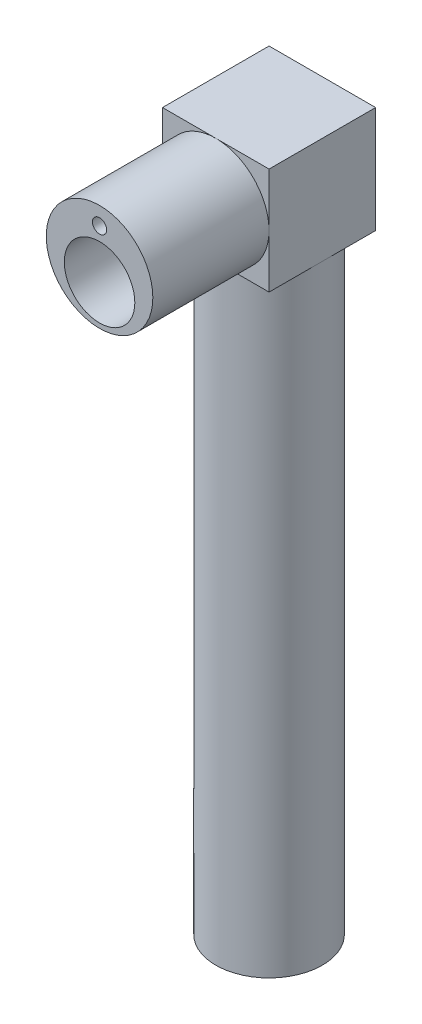
ISO-10303-21;
HEADER;
FILE_DESCRIPTION(('STEP AP214'),'2;1');
FILE_NAME('part.step','',(''),(''),'','','');
FILE_SCHEMA(('AUTOMOTIVE_DESIGN { 1 0 10303 214 1 1 1 1 }'));
ENDSEC;
DATA;
#1=APPLICATION_CONTEXT('core data for automotive mechanical design processes');
#2=APPLICATION_PROTOCOL_DEFINITION('international standard','automotive_design',2000,#1);
#3=PRODUCT_CONTEXT('',#1,'mechanical');
#4=PRODUCT('Part','Part','',(#3));
#5=PRODUCT_RELATED_PRODUCT_CATEGORY('part','',(#4));
#6=PRODUCT_DEFINITION_FORMATION('','',#4);
#7=PRODUCT_DEFINITION_CONTEXT('part definition',#1,'design');
#8=PRODUCT_DEFINITION('design','',#6,#7);
#9=PRODUCT_DEFINITION_SHAPE('','',#8);
#10=(LENGTH_UNIT() NAMED_UNIT(*) SI_UNIT(.MILLI.,.METRE.));
#11=(NAMED_UNIT(*) PLANE_ANGLE_UNIT() SI_UNIT($,.RADIAN.));
#12=(NAMED_UNIT(*) SI_UNIT($,.STERADIAN.) SOLID_ANGLE_UNIT());
#13=UNCERTAINTY_MEASURE_WITH_UNIT(LENGTH_MEASURE(1.E-05),#10,'distance_accuracy_value','');
#14=(GEOMETRIC_REPRESENTATION_CONTEXT(3) GLOBAL_UNCERTAINTY_ASSIGNED_CONTEXT((#13)) GLOBAL_UNIT_ASSIGNED_CONTEXT((#10,
#11,#12)) REPRESENTATION_CONTEXT('',''));
#15=CARTESIAN_POINT('',(0.,0.,0.));
#16=DIRECTION('',(0.,0.,1.));
#17=DIRECTION('',(1.,0.,0.));
#18=AXIS2_PLACEMENT_3D('',#15,#16,#17);
#19=CARTESIAN_POINT('',(28.1,-28.1,-56.2));
#20=DIRECTION('',(0.,1.,0.));
#21=DIRECTION('',(0.,0.,1.));
#22=AXIS2_PLACEMENT_3D('',#19,#20,#21);
#23=PLANE('',#22);
#24=CARTESIAN_POINT('',(0.,-28.1,-28.1));
#25=DIRECTION('',(0.,-1.,0.));
#26=DIRECTION('',(0.,0.,-1.));
#27=AXIS2_PLACEMENT_3D('',#24,#25,#26);
#28=CIRCLE('',#27,28.1);
#29=CARTESIAN_POINT('',(0.,-28.1,0.));
#30=VERTEX_POINT('',#29);
#31=CARTESIAN_POINT('',(-28.1,-28.1,-28.1));
#32=VERTEX_POINT('',#31);
#33=EDGE_CURVE('E408',#30,#32,#28,.T.);
#34=ORIENTED_EDGE('',*,*,#33,.F.);
#35=DIRECTION('',(-1.,0.,0.));
#36=VECTOR('',#35,1.);
#37=CARTESIAN_POINT('',(28.1,-28.1,0.));
#38=LINE('',#37,#36);
#39=CARTESIAN_POINT('',(-28.1,-28.1,0.));
#40=VERTEX_POINT('',#39);
#41=EDGE_CURVE('E311',#30,#40,#38,.T.);
#42=ORIENTED_EDGE('',*,*,#41,.T.);
#43=DIRECTION('',(0.,0.,1.));
#44=VECTOR('',#43,1.);
#45=CARTESIAN_POINT('',(-28.1,-28.1,-56.2));
#46=LINE('',#45,#44);
#47=EDGE_CURVE('E300',#32,#40,#46,.T.);
#48=ORIENTED_EDGE('',*,*,#47,.F.);
#49=EDGE_LOOP('',(#34,#42,#48));
#50=FACE_BOUND('',#49,.T.);
#51=ADVANCED_FACE('F36',(#50),#23,.F.);
#52=CARTESIAN_POINT('',(0.,-28.1,-56.2));
#53=VERTEX_POINT('',#52);
#54=EDGE_CURVE('E233',#32,#53,#28,.T.);
#55=ORIENTED_EDGE('',*,*,#54,.F.);
#56=CARTESIAN_POINT('',(-28.1,-28.1,-56.2));
#57=VERTEX_POINT('',#56);
#58=EDGE_CURVE('E314',#57,#32,#46,.T.);
#59=ORIENTED_EDGE('',*,*,#58,.F.);
#60=DIRECTION('',(-1.,0.,0.));
#61=VECTOR('',#60,1.);
#62=CARTESIAN_POINT('',(28.1,-28.1,-56.2));
#63=LINE('',#62,#61);
#64=EDGE_CURVE('E296',#53,#57,#63,.T.);
#65=ORIENTED_EDGE('',*,*,#64,.F.);
#66=EDGE_LOOP('',(#55,#59,#65));
#67=FACE_BOUND('',#66,.T.);
#68=ADVANCED_FACE('F363',(#67),#23,.F.);
#69=CARTESIAN_POINT('',(28.1,-28.1,-28.1));
#70=VERTEX_POINT('',#69);
#71=EDGE_CURVE('E246',#53,#70,#28,.T.);
#72=ORIENTED_EDGE('',*,*,#71,.F.);
#73=CARTESIAN_POINT('',(28.1,-28.1,-56.2));
#74=VERTEX_POINT('',#73);
#75=EDGE_CURVE('E297',#74,#53,#63,.T.);
#76=ORIENTED_EDGE('',*,*,#75,.F.);
#77=DIRECTION('',(0.,0.,1.));
#78=VECTOR('',#77,1.);
#79=CARTESIAN_POINT('',(28.1,-28.1,-56.2));
#80=LINE('',#79,#78);
#81=EDGE_CURVE('E318',#74,#70,#80,.T.);
#82=ORIENTED_EDGE('',*,*,#81,.T.);
#83=EDGE_LOOP('',(#72,#76,#82));
#84=FACE_BOUND('',#83,.T.);
#85=ADVANCED_FACE('F370',(#84),#23,.F.);
#86=CARTESIAN_POINT('',(0.,0.,61.3));
#87=DIRECTION('',(0.,0.,-1.));
#88=DIRECTION('',(-1.,0.,0.));
#89=AXIS2_PLACEMENT_3D('',#86,#87,#88);
#90=CYLINDRICAL_SURFACE('',#89,28.1);
#91=CARTESIAN_POINT('',(0.,0.,61.3));
#92=DIRECTION('',(0.,0.,1.));
#93=DIRECTION('',(1.,0.,0.));
#94=AXIS2_PLACEMENT_3D('',#91,#92,#93);
#95=CIRCLE('',#94,28.1);
#96=CARTESIAN_POINT('',(28.1,0.,61.3));
#97=VERTEX_POINT('',#96);
#98=EDGE_CURVE('E45',#97,#97,#95,.T.);
#99=ORIENTED_EDGE('',*,*,#98,.F.);
#100=EDGE_LOOP('',(#99));
#101=FACE_BOUND('',#100,.T.);
#102=CARTESIAN_POINT('',(0.,0.,0.));
#103=DIRECTION('',(0.,0.,1.));
#104=DIRECTION('',(1.,0.,0.));
#105=AXIS2_PLACEMENT_3D('',#102,#103,#104);
#106=CIRCLE('',#105,28.1);
#107=CARTESIAN_POINT('',(28.1,0.,0.));
#108=VERTEX_POINT('',#107);
#109=CARTESIAN_POINT('',(0.,28.1,0.));
#110=VERTEX_POINT('',#109);
#111=EDGE_CURVE('E336',#108,#110,#106,.T.);
#112=ORIENTED_EDGE('',*,*,#111,.T.);
#113=CARTESIAN_POINT('',(-28.1,0.,0.));
#114=VERTEX_POINT('',#113);
#115=EDGE_CURVE('E338',#110,#114,#106,.T.);
#116=ORIENTED_EDGE('',*,*,#115,.T.);
#117=EDGE_CURVE('E421',#114,#30,#106,.T.);
#118=ORIENTED_EDGE('',*,*,#117,.T.);
#119=EDGE_CURVE('E331',#30,#108,#106,.T.);
#120=ORIENTED_EDGE('',*,*,#119,.T.);
#121=EDGE_LOOP('',(#112,#116,#118,#120));
#122=FACE_BOUND('',#121,.T.);
#123=ADVANCED_FACE('F38',(#101,#122),#90,.T.);
#124=CARTESIAN_POINT('',(0.,0.,61.3));
#125=DIRECTION('',(0.,0.,1.));
#126=DIRECTION('',(1.,0.,0.));
#127=AXIS2_PLACEMENT_3D('',#124,#125,#126);
#128=PLANE('',#127);
#129=CARTESIAN_POINT('',(0.,18.75,61.3));
#130=DIRECTION('',(0.,0.,1.));
#131=DIRECTION('',(1.,0.,0.));
#132=AXIS2_PLACEMENT_3D('',#129,#130,#131);
#133=CIRCLE('',#132,3.75);
#134=CARTESIAN_POINT('',(3.75,18.75,61.3));
#135=VERTEX_POINT('',#134);
#136=EDGE_CURVE('E618',#135,#135,#133,.T.);
#137=ORIENTED_EDGE('',*,*,#136,.F.);
#138=EDGE_LOOP('',(#137));
#139=FACE_BOUND('',#138,.T.);
#140=CARTESIAN_POINT('',(0.,-7.,61.3));
#141=DIRECTION('',(0.,0.,1.));
#142=DIRECTION('',(1.,0.,0.));
#143=AXIS2_PLACEMENT_3D('',#140,#141,#142);
#144=CIRCLE('',#143,18.6);
#145=CARTESIAN_POINT('',(18.6,-7.,61.3));
#146=VERTEX_POINT('',#145);
#147=EDGE_CURVE('E327',#146,#146,#144,.T.);
#148=ORIENTED_EDGE('',*,*,#147,.F.);
#149=EDGE_LOOP('',(#148));
#150=FACE_BOUND('',#149,.T.);
#151=ORIENTED_EDGE('',*,*,#98,.T.);
#152=EDGE_LOOP('',(#151));
#153=FACE_BOUND('',#152,.T.);
#154=ADVANCED_FACE('F393',(#139,#150,#153),#128,.T.);
#155=CARTESIAN_POINT('',(0.,-7.,2.5));
#156=DIRECTION('',(0.,0.,1.));
#157=DIRECTION('',(1.,0.,0.));
#158=AXIS2_PLACEMENT_3D('',#155,#156,#157);
#159=CYLINDRICAL_SURFACE('',#158,18.6);
#160=CARTESIAN_POINT('',(0.,-7.,2.5));
#161=DIRECTION('',(0.,0.,1.));
#162=DIRECTION('',(1.,0.,0.));
#163=AXIS2_PLACEMENT_3D('',#160,#161,#162);
#164=CIRCLE('',#163,18.6);
#165=CARTESIAN_POINT('',(18.6,-7.,2.5));
#166=VERTEX_POINT('',#165);
#167=EDGE_CURVE('E328',#166,#166,#164,.T.);
#168=ORIENTED_EDGE('',*,*,#167,.F.);
#169=EDGE_LOOP('',(#168));
#170=FACE_BOUND('',#169,.T.);
#171=ORIENTED_EDGE('',*,*,#147,.T.);
#172=EDGE_LOOP('',(#171));
#173=FACE_BOUND('',#172,.T.);
#174=ADVANCED_FACE('F546',(#170,#173),#159,.F.);
#175=CARTESIAN_POINT('',(0.,-7.,2.5));
#176=DIRECTION('',(0.,0.,1.));
#177=DIRECTION('',(1.,0.,0.));
#178=AXIS2_PLACEMENT_3D('',#175,#176,#177);
#179=PLANE('',#178);
#180=CARTESIAN_POINT('',(0.,-7.,2.5));
#181=DIRECTION('',(0.,0.,1.));
#182=DIRECTION('',(1.,0.,0.));
#183=AXIS2_PLACEMENT_3D('',#180,#181,#182);
#184=CIRCLE('',#183,16.1);
#185=CARTESIAN_POINT('',(16.1,-7.,2.5));
#186=VERTEX_POINT('',#185);
#187=EDGE_CURVE('E284',#186,#186,#184,.T.);
#188=ORIENTED_EDGE('',*,*,#187,.F.);
#189=EDGE_LOOP('',(#188));
#190=FACE_BOUND('',#189,.T.);
#191=ORIENTED_EDGE('',*,*,#167,.T.);
#192=EDGE_LOOP('',(#191));
#193=FACE_BOUND('',#192,.T.);
#194=ADVANCED_FACE('F445',(#190,#193),#179,.T.);
#195=CARTESIAN_POINT('',(0.,0.,0.));
#196=DIRECTION('',(0.,0.,1.));
#197=DIRECTION('',(1.,0.,0.));
#198=AXIS2_PLACEMENT_3D('',#195,#196,#197);
#199=PLANE('',#198);
#200=ORIENTED_EDGE('',*,*,#111,.F.);
#201=DIRECTION('',(0.,-1.,0.));
#202=VECTOR('',#201,1.);
#203=CARTESIAN_POINT('',(28.1,-28.1,0.));
#204=LINE('',#203,#202);
#205=CARTESIAN_POINT('',(28.1,28.1,0.));
#206=VERTEX_POINT('',#205);
#207=EDGE_CURVE('E309',#206,#108,#204,.T.);
#208=ORIENTED_EDGE('',*,*,#207,.F.);
#209=DIRECTION('',(1.,0.,0.));
#210=VECTOR('',#209,1.);
#211=CARTESIAN_POINT('',(28.1,28.1,0.));
#212=LINE('',#211,#210);
#213=EDGE_CURVE('E304',#110,#206,#212,.T.);
#214=ORIENTED_EDGE('',*,*,#213,.F.);
#215=EDGE_LOOP('',(#200,#208,#214));
#216=FACE_BOUND('',#215,.T.);
#217=ADVANCED_FACE('F431',(#216),#199,.T.);
#218=ORIENTED_EDGE('',*,*,#115,.F.);
#219=CARTESIAN_POINT('',(-28.1,28.1,0.));
#220=VERTEX_POINT('',#219);
#221=EDGE_CURVE('E305',#220,#110,#212,.T.);
#222=ORIENTED_EDGE('',*,*,#221,.F.);
#223=DIRECTION('',(0.,1.,0.));
#224=VECTOR('',#223,1.);
#225=CARTESIAN_POINT('',(-28.1,-28.1,0.));
#226=LINE('',#225,#224);
#227=EDGE_CURVE('E287',#114,#220,#226,.T.);
#228=ORIENTED_EDGE('',*,*,#227,.F.);
#229=EDGE_LOOP('',(#218,#222,#228));
#230=FACE_BOUND('',#229,.T.);
#231=ADVANCED_FACE('F436',(#230),#199,.T.);
#232=ORIENTED_EDGE('',*,*,#117,.F.);
#233=EDGE_CURVE('E301',#40,#114,#226,.T.);
#234=ORIENTED_EDGE('',*,*,#233,.F.);
#235=ORIENTED_EDGE('',*,*,#41,.F.);
#236=EDGE_LOOP('',(#232,#234,#235));
#237=FACE_BOUND('',#236,.T.);
#238=ADVANCED_FACE('F438',(#237),#199,.T.);
#239=ORIENTED_EDGE('',*,*,#119,.F.);
#240=CARTESIAN_POINT('',(28.1,-28.1,0.));
#241=VERTEX_POINT('',#240);
#242=EDGE_CURVE('E292',#241,#30,#38,.T.);
#243=ORIENTED_EDGE('',*,*,#242,.F.);
#244=EDGE_CURVE('E308',#108,#241,#204,.T.);
#245=ORIENTED_EDGE('',*,*,#244,.F.);
#246=EDGE_LOOP('',(#239,#243,#245));
#247=FACE_BOUND('',#246,.T.);
#248=ADVANCED_FACE('F418',(#247),#199,.T.);
#249=CARTESIAN_POINT('',(-28.1,-28.1,-56.2));
#250=DIRECTION('',(1.,0.,0.));
#251=DIRECTION('',(0.,0.,-1.));
#252=AXIS2_PLACEMENT_3D('',#249,#250,#251);
#253=PLANE('',#252);
#254=ORIENTED_EDGE('',*,*,#233,.T.);
#255=ORIENTED_EDGE('',*,*,#227,.T.);
#256=DIRECTION('',(0.,0.,1.));
#257=VECTOR('',#256,1.);
#258=CARTESIAN_POINT('',(-28.1,28.1,-56.2));
#259=LINE('',#258,#257);
#260=CARTESIAN_POINT('',(-28.1,28.1,-56.2));
#261=VERTEX_POINT('',#260);
#262=EDGE_CURVE('E324',#261,#220,#259,.T.);
#263=ORIENTED_EDGE('',*,*,#262,.F.);
#264=DIRECTION('',(0.,1.,0.));
#265=VECTOR('',#264,1.);
#266=CARTESIAN_POINT('',(-28.1,-28.1,-56.2));
#267=LINE('',#266,#265);
#268=EDGE_CURVE('E288',#57,#261,#267,.T.);
#269=ORIENTED_EDGE('',*,*,#268,.F.);
#270=ORIENTED_EDGE('',*,*,#58,.T.);
#271=ORIENTED_EDGE('',*,*,#47,.T.);
#272=EDGE_LOOP('',(#254,#255,#263,#269,#270,#271));
#273=FACE_BOUND('',#272,.T.);
#274=ADVANCED_FACE('F425',(#273),#253,.F.);
#275=CARTESIAN_POINT('',(28.1,28.1,-56.2));
#276=DIRECTION('',(0.,-1.,0.));
#277=DIRECTION('',(0.,0.,-1.));
#278=AXIS2_PLACEMENT_3D('',#275,#276,#277);
#279=PLANE('',#278);
#280=ORIENTED_EDGE('',*,*,#221,.T.);
#281=ORIENTED_EDGE('',*,*,#213,.T.);
#282=DIRECTION('',(0.,0.,1.));
#283=VECTOR('',#282,1.);
#284=CARTESIAN_POINT('',(28.1,28.1,-56.2));
#285=LINE('',#284,#283);
#286=CARTESIAN_POINT('',(28.1,28.1,-56.2));
#287=VERTEX_POINT('',#286);
#288=EDGE_CURVE('E321',#287,#206,#285,.T.);
#289=ORIENTED_EDGE('',*,*,#288,.F.);
#290=DIRECTION('',(1.,0.,0.));
#291=VECTOR('',#290,1.);
#292=CARTESIAN_POINT('',(28.1,28.1,-56.2));
#293=LINE('',#292,#291);
#294=EDGE_CURVE('E291',#261,#287,#293,.T.);
#295=ORIENTED_EDGE('',*,*,#294,.F.);
#296=ORIENTED_EDGE('',*,*,#262,.T.);
#297=EDGE_LOOP('',(#280,#281,#289,#295,#296));
#298=FACE_BOUND('',#297,.T.);
#299=ADVANCED_FACE('F386',(#298),#279,.F.);
#300=CARTESIAN_POINT('',(28.1,-28.1,-56.2));
#301=DIRECTION('',(-1.,0.,0.));
#302=DIRECTION('',(0.,0.,1.));
#303=AXIS2_PLACEMENT_3D('',#300,#301,#302);
#304=PLANE('',#303);
#305=ORIENTED_EDGE('',*,*,#207,.T.);
#306=ORIENTED_EDGE('',*,*,#244,.T.);
#307=EDGE_CURVE('E317',#70,#241,#80,.T.);
#308=ORIENTED_EDGE('',*,*,#307,.F.);
#309=ORIENTED_EDGE('',*,*,#81,.F.);
#310=DIRECTION('',(0.,-1.,0.));
#311=VECTOR('',#310,1.);
#312=CARTESIAN_POINT('',(28.1,-28.1,-56.2));
#313=LINE('',#312,#311);
#314=EDGE_CURVE('E294',#287,#74,#313,.T.);
#315=ORIENTED_EDGE('',*,*,#314,.F.);
#316=ORIENTED_EDGE('',*,*,#288,.T.);
#317=EDGE_LOOP('',(#305,#306,#308,#309,#315,#316));
#318=FACE_BOUND('',#317,.T.);
#319=ADVANCED_FACE('F377',(#318),#304,.F.);
#320=EDGE_CURVE('E249',#70,#30,#28,.T.);
#321=ORIENTED_EDGE('',*,*,#320,.F.);
#322=ORIENTED_EDGE('',*,*,#307,.T.);
#323=ORIENTED_EDGE('',*,*,#242,.T.);
#324=EDGE_LOOP('',(#321,#322,#323));
#325=FACE_BOUND('',#324,.T.);
#326=ADVANCED_FACE('F366',(#325),#23,.F.);
#327=CARTESIAN_POINT('',(0.,0.,-56.2));
#328=DIRECTION('',(0.,0.,1.));
#329=DIRECTION('',(1.,0.,0.));
#330=AXIS2_PLACEMENT_3D('',#327,#328,#329);
#331=PLANE('',#330);
#332=DIRECTION('',(1.,0.,0.));
#333=VECTOR('',#332,1.);
#334=CARTESIAN_POINT('',(24.8986957114994,24.8896277262816,-56.2));
#335=LINE('',#334,#333);
#336=CARTESIAN_POINT('',(-24.8986957114994,24.8896277262816,-56.2));
#337=VERTEX_POINT('',#336);
#338=CARTESIAN_POINT('',(24.8986957114994,24.8896277262816,-56.2));
#339=VERTEX_POINT('',#338);
#340=EDGE_CURVE('E265',#337,#339,#335,.T.);
#341=ORIENTED_EDGE('',*,*,#340,.F.);
#342=DIRECTION('',(0.,1.,0.));
#343=VECTOR('',#342,1.);
#344=CARTESIAN_POINT('',(-24.8986957114994,-24.8896277262816,-56.2));
#345=LINE('',#344,#343);
#346=CARTESIAN_POINT('',(-24.8986957114994,-24.8896277262816,-56.2));
#347=VERTEX_POINT('',#346);
#348=EDGE_CURVE('E245',#347,#337,#345,.T.);
#349=ORIENTED_EDGE('',*,*,#348,.F.);
#350=DIRECTION('',(-1.,0.,0.));
#351=VECTOR('',#350,1.);
#352=CARTESIAN_POINT('',(24.8986957114994,-24.8896277262816,-56.2));
#353=LINE('',#352,#351);
#354=CARTESIAN_POINT('',(24.8986957114994,-24.8896277262816,-56.2));
#355=VERTEX_POINT('',#354);
#356=EDGE_CURVE('E254',#355,#347,#353,.T.);
#357=ORIENTED_EDGE('',*,*,#356,.F.);
#358=DIRECTION('',(0.,-1.,0.));
#359=VECTOR('',#358,1.);
#360=CARTESIAN_POINT('',(24.8986957114994,-24.8896277262816,-56.2));
#361=LINE('',#360,#359);
#362=EDGE_CURVE('E268',#339,#355,#361,.T.);
#363=ORIENTED_EDGE('',*,*,#362,.F.);
#364=EDGE_LOOP('',(#341,#349,#357,#363));
#365=FACE_BOUND('',#364,.T.);
#366=ORIENTED_EDGE('',*,*,#268,.T.);
#367=ORIENTED_EDGE('',*,*,#294,.T.);
#368=ORIENTED_EDGE('',*,*,#314,.T.);
#369=ORIENTED_EDGE('',*,*,#75,.T.);
#370=ORIENTED_EDGE('',*,*,#64,.T.);
#371=EDGE_LOOP('',(#366,#367,#368,#369,#370));
#372=FACE_BOUND('',#371,.T.);
#373=ADVANCED_FACE('F376',(#365,#372),#331,.F.);
#374=CARTESIAN_POINT('',(0.,-7.,-2.5));
#375=DIRECTION('',(0.,0.,1.));
#376=DIRECTION('',(1.,0.,0.));
#377=AXIS2_PLACEMENT_3D('',#374,#375,#376);
#378=CYLINDRICAL_SURFACE('',#377,16.1);
#379=CARTESIAN_POINT('',(0.,-7.,-2.5));
#380=DIRECTION('',(0.,0.,1.));
#381=DIRECTION('',(1.,0.,0.));
#382=AXIS2_PLACEMENT_3D('',#379,#380,#381);
#383=CIRCLE('',#382,16.1);
#384=CARTESIAN_POINT('',(16.1,-7.,-2.5));
#385=VERTEX_POINT('',#384);
#386=EDGE_CURVE('E275',#385,#385,#383,.T.);
#387=ORIENTED_EDGE('',*,*,#386,.F.);
#388=EDGE_LOOP('',(#387));
#389=FACE_BOUND('',#388,.T.);
#390=ORIENTED_EDGE('',*,*,#187,.T.);
#391=EDGE_LOOP('',(#390));
#392=FACE_BOUND('',#391,.T.);
#393=ADVANCED_FACE('F383',(#389,#392),#378,.F.);
#394=CARTESIAN_POINT('',(-24.8986957114994,-24.8896277262816,-2.5));
#395=DIRECTION('',(-1.,0.,0.));
#396=DIRECTION('',(0.,0.,1.));
#397=AXIS2_PLACEMENT_3D('',#394,#395,#396);
#398=PLANE('',#397);
#399=ORIENTED_EDGE('',*,*,#348,.T.);
#400=DIRECTION('',(0.,0.,-1.));
#401=VECTOR('',#400,1.);
#402=CARTESIAN_POINT('',(-24.8986957114994,24.8896277262816,-2.5));
#403=LINE('',#402,#401);
#404=CARTESIAN_POINT('',(-24.8986957114994,24.8896277262816,-2.5));
#405=VERTEX_POINT('',#404);
#406=EDGE_CURVE('E263',#405,#337,#403,.T.);
#407=ORIENTED_EDGE('',*,*,#406,.F.);
#408=DIRECTION('',(0.,1.,0.));
#409=VECTOR('',#408,1.);
#410=CARTESIAN_POINT('',(-24.8986957114994,-24.8896277262816,-2.5));
#411=LINE('',#410,#409);
#412=CARTESIAN_POINT('',(-24.8986957114994,-24.8896277262816,-2.5));
#413=VERTEX_POINT('',#412);
#414=EDGE_CURVE('E250',#413,#405,#411,.T.);
#415=ORIENTED_EDGE('',*,*,#414,.F.);
#416=DIRECTION('',(0.,0.,-1.));
#417=VECTOR('',#416,1.);
#418=CARTESIAN_POINT('',(-24.8986957114994,-24.8896277262816,-2.5));
#419=LINE('',#418,#417);
#420=EDGE_CURVE('E273',#413,#347,#419,.T.);
#421=ORIENTED_EDGE('',*,*,#420,.T.);
#422=EDGE_LOOP('',(#399,#407,#415,#421));
#423=FACE_BOUND('',#422,.T.);
#424=ADVANCED_FACE('F449',(#423),#398,.F.);
#425=CARTESIAN_POINT('',(24.8986957114994,-24.8896277262816,-2.5));
#426=DIRECTION('',(0.,-1.,0.));
#427=DIRECTION('',(0.,0.,-1.));
#428=AXIS2_PLACEMENT_3D('',#425,#426,#427);
#429=PLANE('',#428);
#430=CARTESIAN_POINT('',(0.,-24.8896277262816,-28.3320788958154));
#431=DIRECTION('',(0.,-1.,0.));
#432=DIRECTION('',(0.,0.,-1.));
#433=AXIS2_PLACEMENT_3D('',#430,#431,#432);
#434=CIRCLE('',#433,22.5);
#435=CARTESIAN_POINT('',(22.5,-24.8896277262816,-28.3320788958154));
#436=VERTEX_POINT('',#435);
#437=CARTESIAN_POINT('',(-22.5,-24.8896277262816,-28.3320788958154));
#438=VERTEX_POINT('',#437);
#439=EDGE_CURVE('E200',#436,#438,#434,.F.);
#440=ORIENTED_EDGE('',*,*,#439,.F.);
#441=CARTESIAN_POINT('',(18.75,-24.8896277262816,-28.3320788958154));
#442=DIRECTION('',(0.,-1.,0.));
#443=DIRECTION('',(0.,0.,-1.));
#444=AXIS2_PLACEMENT_3D('',#441,#442,#443);
#445=CIRCLE('',#444,3.75);
#446=CARTESIAN_POINT('',(15.,-24.8896277262816,-28.3320788958154));
#447=VERTEX_POINT('',#446);
#448=EDGE_CURVE('E53',#436,#447,#445,.T.);
#449=ORIENTED_EDGE('',*,*,#448,.T.);
#450=CARTESIAN_POINT('',(0.,-24.8896277262816,-28.3320788958154));
#451=DIRECTION('',(0.,-1.,0.));
#452=DIRECTION('',(0.,0.,-1.));
#453=AXIS2_PLACEMENT_3D('',#450,#451,#452);
#454=CIRCLE('',#453,15.);
#455=CARTESIAN_POINT('',(-15.,-24.8896277262816,-28.3320788958154));
#456=VERTEX_POINT('',#455);
#457=EDGE_CURVE('E203',#456,#447,#454,.T.);
#458=ORIENTED_EDGE('',*,*,#457,.F.);
#459=CARTESIAN_POINT('',(-18.75,-24.8896277262816,-28.3320788958154));
#460=DIRECTION('',(0.,-1.,0.));
#461=DIRECTION('',(0.,0.,-1.));
#462=AXIS2_PLACEMENT_3D('',#459,#460,#461);
#463=CIRCLE('',#462,3.75);
#464=EDGE_CURVE('E172',#456,#438,#463,.T.);
#465=ORIENTED_EDGE('',*,*,#464,.T.);
#466=EDGE_LOOP('',(#440,#449,#458,#465));
#467=FACE_BOUND('',#466,.T.);
#468=ORIENTED_EDGE('',*,*,#356,.T.);
#469=ORIENTED_EDGE('',*,*,#420,.F.);
#470=DIRECTION('',(-1.,0.,0.));
#471=VECTOR('',#470,1.);
#472=CARTESIAN_POINT('',(24.8986957114994,-24.8896277262816,-2.5));
#473=LINE('',#472,#471);
#474=CARTESIAN_POINT('',(24.8986957114994,-24.8896277262816,-2.5));
#475=VERTEX_POINT('',#474);
#476=EDGE_CURVE('E260',#475,#413,#473,.T.);
#477=ORIENTED_EDGE('',*,*,#476,.F.);
#478=DIRECTION('',(0.,0.,-1.));
#479=VECTOR('',#478,1.);
#480=CARTESIAN_POINT('',(24.8986957114994,-24.8896277262816,-2.5));
#481=LINE('',#480,#479);
#482=EDGE_CURVE('E276',#475,#355,#481,.T.);
#483=ORIENTED_EDGE('',*,*,#482,.T.);
#484=EDGE_LOOP('',(#468,#469,#477,#483));
#485=FACE_BOUND('',#484,.T.);
#486=ADVANCED_FACE('F453',(#467,#485),#429,.F.);
#487=CARTESIAN_POINT('',(24.8986957114994,-24.8896277262816,-2.5));
#488=DIRECTION('',(1.,0.,0.));
#489=DIRECTION('',(0.,0.,-1.));
#490=AXIS2_PLACEMENT_3D('',#487,#488,#489);
#491=PLANE('',#490);
#492=ORIENTED_EDGE('',*,*,#362,.T.);
#493=ORIENTED_EDGE('',*,*,#482,.F.);
#494=DIRECTION('',(0.,-1.,0.));
#495=VECTOR('',#494,1.);
#496=CARTESIAN_POINT('',(24.8986957114994,-24.8896277262816,-2.5));
#497=LINE('',#496,#495);
#498=CARTESIAN_POINT('',(24.8986957114994,24.8896277262816,-2.5));
#499=VERTEX_POINT('',#498);
#500=EDGE_CURVE('E257',#499,#475,#497,.T.);
#501=ORIENTED_EDGE('',*,*,#500,.F.);
#502=DIRECTION('',(0.,0.,-1.));
#503=VECTOR('',#502,1.);
#504=CARTESIAN_POINT('',(24.8986957114994,24.8896277262816,-2.5));
#505=LINE('',#504,#503);
#506=EDGE_CURVE('E278',#499,#339,#505,.T.);
#507=ORIENTED_EDGE('',*,*,#506,.T.);
#508=EDGE_LOOP('',(#492,#493,#501,#507));
#509=FACE_BOUND('',#508,.T.);
#510=ADVANCED_FACE('F459',(#509),#491,.F.);
#511=CARTESIAN_POINT('',(24.8986957114994,24.8896277262816,-2.5));
#512=DIRECTION('',(0.,1.,0.));
#513=DIRECTION('',(0.,0.,1.));
#514=AXIS2_PLACEMENT_3D('',#511,#512,#513);
#515=PLANE('',#514);
#516=ORIENTED_EDGE('',*,*,#340,.T.);
#517=ORIENTED_EDGE('',*,*,#506,.F.);
#518=DIRECTION('',(1.,0.,0.));
#519=VECTOR('',#518,1.);
#520=CARTESIAN_POINT('',(24.8986957114994,24.8896277262816,-2.5));
#521=LINE('',#520,#519);
#522=EDGE_CURVE('E253',#405,#499,#521,.T.);
#523=ORIENTED_EDGE('',*,*,#522,.F.);
#524=ORIENTED_EDGE('',*,*,#406,.T.);
#525=EDGE_LOOP('',(#516,#517,#523,#524));
#526=FACE_BOUND('',#525,.T.);
#527=ADVANCED_FACE('F455',(#526),#515,.F.);
#528=CARTESIAN_POINT('',(0.,0.,-2.5));
#529=DIRECTION('',(0.,0.,1.));
#530=DIRECTION('',(1.,0.,0.));
#531=AXIS2_PLACEMENT_3D('',#528,#529,#530);
#532=PLANE('',#531);
#533=CARTESIAN_POINT('',(0.,18.75,-2.5));
#534=DIRECTION('',(0.,0.,1.));
#535=DIRECTION('',(1.,0.,0.));
#536=AXIS2_PLACEMENT_3D('',#533,#534,#535);
#537=CIRCLE('',#536,3.75);
#538=CARTESIAN_POINT('',(3.75,18.75,-2.5));
#539=VERTEX_POINT('',#538);
#540=EDGE_CURVE('E40',#539,#539,#537,.T.);
#541=ORIENTED_EDGE('',*,*,#540,.T.);
#542=EDGE_LOOP('',(#541));
#543=FACE_BOUND('',#542,.T.);
#544=ORIENTED_EDGE('',*,*,#386,.T.);
#545=EDGE_LOOP('',(#544));
#546=FACE_BOUND('',#545,.T.);
#547=ORIENTED_EDGE('',*,*,#414,.T.);
#548=ORIENTED_EDGE('',*,*,#522,.T.);
#549=ORIENTED_EDGE('',*,*,#500,.T.);
#550=ORIENTED_EDGE('',*,*,#476,.T.);
#551=EDGE_LOOP('',(#547,#548,#549,#550));
#552=FACE_BOUND('',#551,.T.);
#553=ADVANCED_FACE('F458',(#543,#546,#552),#532,.F.);
#554=CARTESIAN_POINT('',(0.,-349.6,-28.1));
#555=DIRECTION('',(0.,1.,0.));
#556=DIRECTION('',(0.,0.,1.));
#557=AXIS2_PLACEMENT_3D('',#554,#555,#556);
#558=CYLINDRICAL_SURFACE('',#557,28.1);
#559=CARTESIAN_POINT('',(0.,-349.6,-28.1));
#560=DIRECTION('',(0.,-1.,0.));
#561=DIRECTION('',(0.,0.,-1.));
#562=AXIS2_PLACEMENT_3D('',#559,#560,#561);
#563=CIRCLE('',#562,28.1);
#564=CARTESIAN_POINT('',(0.,-349.6,-56.2));
#565=VERTEX_POINT('',#564);
#566=EDGE_CURVE('E242',#565,#565,#563,.T.);
#567=ORIENTED_EDGE('',*,*,#566,.F.);
#568=EDGE_LOOP('',(#567));
#569=FACE_BOUND('',#568,.T.);
#570=ORIENTED_EDGE('',*,*,#71,.T.);
#571=ORIENTED_EDGE('',*,*,#320,.T.);
#572=ORIENTED_EDGE('',*,*,#33,.T.);
#573=ORIENTED_EDGE('',*,*,#54,.T.);
#574=EDGE_LOOP('',(#570,#571,#572,#573));
#575=FACE_BOUND('',#574,.T.);
#576=ADVANCED_FACE('F407',(#569,#575),#558,.T.);
#577=CARTESIAN_POINT('',(0.,-349.6,-28.1));
#578=DIRECTION('',(0.,-1.,0.));
#579=DIRECTION('',(0.,0.,-1.));
#580=AXIS2_PLACEMENT_3D('',#577,#578,#579);
#581=PLANE('',#580);
#582=CARTESIAN_POINT('',(18.75,-349.6,-28.3320788958154));
#583=DIRECTION('',(0.,-1.,0.));
#584=DIRECTION('',(0.,0.,-1.));
#585=AXIS2_PLACEMENT_3D('',#582,#583,#584);
#586=CIRCLE('',#585,3.75);
#587=CARTESIAN_POINT('',(22.5,-349.6,-28.3320788958154));
#588=VERTEX_POINT('',#587);
#589=CARTESIAN_POINT('',(15.,-349.6,-28.3320788958154));
#590=VERTEX_POINT('',#589);
#591=EDGE_CURVE('E188',#588,#590,#586,.T.);
#592=ORIENTED_EDGE('',*,*,#591,.F.);
#593=CARTESIAN_POINT('',(0.,-349.6,-28.3320788958154));
#594=DIRECTION('',(0.,-1.,0.));
#595=DIRECTION('',(-1.,0.,0.));
#596=AXIS2_PLACEMENT_3D('',#593,#594,#595);
#597=CIRCLE('',#596,22.5);
#598=CARTESIAN_POINT('',(-22.5,-349.6,-28.3320788958154));
#599=VERTEX_POINT('',#598);
#600=EDGE_CURVE('E187',#599,#588,#597,.T.);
#601=ORIENTED_EDGE('',*,*,#600,.F.);
#602=CARTESIAN_POINT('',(-18.75,-349.6,-28.3320788958154));
#603=DIRECTION('',(0.,-1.,0.));
#604=DIRECTION('',(0.,0.,-1.));
#605=AXIS2_PLACEMENT_3D('',#602,#603,#604);
#606=CIRCLE('',#605,3.75);
#607=CARTESIAN_POINT('',(-15.,-349.6,-28.3320788958154));
#608=VERTEX_POINT('',#607);
#609=EDGE_CURVE('E61',#608,#599,#606,.T.);
#610=ORIENTED_EDGE('',*,*,#609,.F.);
#611=CARTESIAN_POINT('',(0.,-349.6,-28.3320788958154));
#612=DIRECTION('',(0.,-1.,0.));
#613=DIRECTION('',(-1.,0.,0.));
#614=AXIS2_PLACEMENT_3D('',#611,#612,#613);
#615=CIRCLE('',#614,15.);
#616=EDGE_CURVE('E185',#608,#590,#615,.T.);
#617=ORIENTED_EDGE('',*,*,#616,.T.);
#618=EDGE_LOOP('',(#592,#601,#610,#617));
#619=FACE_BOUND('',#618,.T.);
#620=CARTESIAN_POINT('',(0.,-349.6,-28.3320788958154));
#621=DIRECTION('',(0.,-1.,0.));
#622=DIRECTION('',(0.,0.,-1.));
#623=AXIS2_PLACEMENT_3D('',#620,#621,#622);
#624=CIRCLE('',#623,6.025);
#625=CARTESIAN_POINT('',(0.,-349.6,-34.3570788958154));
#626=VERTEX_POINT('',#625);
#627=EDGE_CURVE('E205',#626,#626,#624,.T.);
#628=ORIENTED_EDGE('',*,*,#627,.F.);
#629=EDGE_LOOP('',(#628));
#630=FACE_BOUND('',#629,.T.);
#631=ORIENTED_EDGE('',*,*,#566,.T.);
#632=EDGE_LOOP('',(#631));
#633=FACE_BOUND('',#632,.T.);
#634=ADVANCED_FACE('F183',(#619,#630,#633),#581,.T.);
#635=CARTESIAN_POINT('',(0.,-349.5,-28.3320788958154));
#636=DIRECTION('',(0.,-1.,0.));
#637=DIRECTION('',(0.,0.,-1.));
#638=AXIS2_PLACEMENT_3D('',#635,#636,#637);
#639=PLANE('',#638);
#640=CARTESIAN_POINT('',(0.,-349.5,-28.3320788958154));
#641=DIRECTION('',(0.,-1.,0.));
#642=DIRECTION('',(0.,0.,-1.));
#643=AXIS2_PLACEMENT_3D('',#640,#641,#642);
#644=CIRCLE('',#643,6.025);
#645=CARTESIAN_POINT('',(0.,-349.5,-34.3570788958154));
#646=VERTEX_POINT('',#645);
#647=EDGE_CURVE('E206',#646,#646,#644,.T.);
#648=ORIENTED_EDGE('',*,*,#647,.T.);
#649=EDGE_LOOP('',(#648));
#650=FACE_BOUND('',#649,.T.);
#651=CARTESIAN_POINT('',(0.,-349.5,-28.3320788958154));
#652=DIRECTION('',(0.,-1.,0.));
#653=DIRECTION('',(0.,0.,-1.));
#654=AXIS2_PLACEMENT_3D('',#651,#652,#653);
#655=CIRCLE('',#654,3.);
#656=CARTESIAN_POINT('',(0.,-349.5,-31.3320788958154));
#657=VERTEX_POINT('',#656);
#658=EDGE_CURVE('E209',#657,#657,#655,.F.);
#659=ORIENTED_EDGE('',*,*,#658,.T.);
#660=EDGE_LOOP('',(#659));
#661=FACE_BOUND('',#660,.T.);
#662=ADVANCED_FACE('F342',(#650,#661),#639,.T.);
#663=CARTESIAN_POINT('',(0.,-349.5,-28.3320788958154));
#664=DIRECTION('',(0.,-1.,0.));
#665=DIRECTION('',(0.,0.,-1.));
#666=AXIS2_PLACEMENT_3D('',#663,#664,#665);
#667=CYLINDRICAL_SURFACE('',#666,6.025);
#668=ORIENTED_EDGE('',*,*,#647,.F.);
#669=EDGE_LOOP('',(#668));
#670=FACE_BOUND('',#669,.T.);
#671=ORIENTED_EDGE('',*,*,#627,.T.);
#672=EDGE_LOOP('',(#671));
#673=FACE_BOUND('',#672,.T.);
#674=ADVANCED_FACE('F476',(#670,#673),#667,.F.);
#675=CARTESIAN_POINT('',(0.,-348.6,-28.3320788958154));
#676=DIRECTION('',(0.,-1.,0.));
#677=DIRECTION('',(0.,0.,-1.));
#678=AXIS2_PLACEMENT_3D('',#675,#676,#677);
#679=PLANE('',#678);
#680=DIRECTION('',(-1.,0.,0.));
#681=VECTOR('',#680,1.);
#682=CARTESIAN_POINT('',(1.6583123951777,-348.6,-30.8320788958154));
#683=LINE('',#682,#681);
#684=CARTESIAN_POINT('',(1.6583123951777,-348.6,-30.8320788958154));
#685=VERTEX_POINT('',#684);
#686=CARTESIAN_POINT('',(-1.6583123951777,-348.6,-30.8320788958154));
#687=VERTEX_POINT('',#686);
#688=EDGE_CURVE('E215',#685,#687,#683,.T.);
#689=ORIENTED_EDGE('',*,*,#688,.T.);
#690=CARTESIAN_POINT('',(0.,-348.6,-28.3320788958154));
#691=DIRECTION('',(0.,-1.,0.));
#692=DIRECTION('',(0.,0.,-1.));
#693=AXIS2_PLACEMENT_3D('',#690,#691,#692);
#694=CIRCLE('',#693,3.);
#695=EDGE_CURVE('E212',#687,#685,#694,.T.);
#696=ORIENTED_EDGE('',*,*,#695,.T.);
#697=EDGE_LOOP('',(#689,#696));
#698=FACE_BOUND('',#697,.T.);
#699=ADVANCED_FACE('F358',(#698),#679,.T.);
#700=CARTESIAN_POINT('',(1.6583123951777,-339.6,-30.8320788958154));
#701=DIRECTION('',(0.,0.,-1.));
#702=DIRECTION('',(-1.,0.,0.));
#703=AXIS2_PLACEMENT_3D('',#700,#701,#702);
#704=PLANE('',#703);
#705=ORIENTED_EDGE('',*,*,#688,.F.);
#706=DIRECTION('',(0.,-1.,0.));
#707=VECTOR('',#706,1.);
#708=CARTESIAN_POINT('',(1.6583123951777,-339.6,-30.8320788958154));
#709=LINE('',#708,#707);
#710=CARTESIAN_POINT('',(1.6583123951777,-339.6,-30.8320788958154));
#711=VERTEX_POINT('',#710);
#712=EDGE_CURVE('E230',#711,#685,#709,.T.);
#713=ORIENTED_EDGE('',*,*,#712,.F.);
#714=DIRECTION('',(1.,0.,0.));
#715=VECTOR('',#714,1.);
#716=CARTESIAN_POINT('',(1.6583123951777,-339.6,-30.8320788958154));
#717=LINE('',#716,#715);
#718=CARTESIAN_POINT('',(-1.6583123951777,-339.6,-30.8320788958154));
#719=VERTEX_POINT('',#718);
#720=EDGE_CURVE('E226',#719,#711,#717,.T.);
#721=ORIENTED_EDGE('',*,*,#720,.F.);
#722=DIRECTION('',(0.,-1.,0.));
#723=VECTOR('',#722,1.);
#724=CARTESIAN_POINT('',(-1.6583123951777,-339.6,-30.8320788958154));
#725=LINE('',#724,#723);
#726=EDGE_CURVE('E234',#719,#687,#725,.T.);
#727=ORIENTED_EDGE('',*,*,#726,.T.);
#728=EDGE_LOOP('',(#705,#713,#721,#727));
#729=FACE_BOUND('',#728,.T.);
#730=ADVANCED_FACE('F487',(#729),#704,.F.);
#731=CARTESIAN_POINT('',(0.,-339.6,-28.3320788958154));
#732=DIRECTION('',(0.,-1.,0.));
#733=DIRECTION('',(0.,0.,-1.));
#734=AXIS2_PLACEMENT_3D('',#731,#732,#733);
#735=PLANE('',#734);
#736=CARTESIAN_POINT('',(0.,-339.6,-28.3320788958154));
#737=DIRECTION('',(0.,-1.,0.));
#738=DIRECTION('',(0.,0.,-1.));
#739=AXIS2_PLACEMENT_3D('',#736,#737,#738);
#740=CIRCLE('',#739,3.);
#741=CARTESIAN_POINT('',(1.6583123951777,-339.6,-25.8320788958154));
#742=VERTEX_POINT('',#741);
#743=EDGE_CURVE('E217',#711,#742,#740,.T.);
#744=ORIENTED_EDGE('',*,*,#743,.T.);
#745=DIRECTION('',(-1.,0.,0.));
#746=VECTOR('',#745,1.);
#747=CARTESIAN_POINT('',(1.6583123951777,-339.6,-25.8320788958154));
#748=LINE('',#747,#746);
#749=CARTESIAN_POINT('',(-1.6583123951777,-339.6,-25.8320788958154));
#750=VERTEX_POINT('',#749);
#751=EDGE_CURVE('E220',#742,#750,#748,.T.);
#752=ORIENTED_EDGE('',*,*,#751,.T.);
#753=CARTESIAN_POINT('',(0.,-339.6,-28.3320788958154));
#754=DIRECTION('',(0.,-1.,0.));
#755=DIRECTION('',(0.,0.,-1.));
#756=AXIS2_PLACEMENT_3D('',#753,#754,#755);
#757=CIRCLE('',#756,3.);
#758=EDGE_CURVE('E223',#750,#719,#757,.T.);
#759=ORIENTED_EDGE('',*,*,#758,.T.);
#760=ORIENTED_EDGE('',*,*,#720,.T.);
#761=EDGE_LOOP('',(#744,#752,#759,#760));
#762=FACE_BOUND('',#761,.T.);
#763=ADVANCED_FACE('F489',(#762),#735,.T.);
#764=CARTESIAN_POINT('',(1.6583123951777,-339.6,-25.8320788958154));
#765=DIRECTION('',(0.,0.,1.));
#766=DIRECTION('',(1.,0.,0.));
#767=AXIS2_PLACEMENT_3D('',#764,#765,#766);
#768=PLANE('',#767);
#769=DIRECTION('',(1.,0.,0.));
#770=VECTOR('',#769,1.);
#771=CARTESIAN_POINT('',(1.6583123951777,-348.6,-25.8320788958154));
#772=LINE('',#771,#770);
#773=CARTESIAN_POINT('',(-1.6583123951777,-348.6,-25.8320788958154));
#774=VERTEX_POINT('',#773);
#775=CARTESIAN_POINT('',(1.65831239517772,-348.6,-25.8320788958154));
#776=VERTEX_POINT('',#775);
#777=EDGE_CURVE('E11',#774,#776,#772,.T.);
#778=ORIENTED_EDGE('',*,*,#777,.F.);
#779=DIRECTION('',(0.,-1.,0.));
#780=VECTOR('',#779,1.);
#781=CARTESIAN_POINT('',(-1.6583123951777,-339.6,-25.8320788958154));
#782=LINE('',#781,#780);
#783=EDGE_CURVE('E237',#750,#774,#782,.T.);
#784=ORIENTED_EDGE('',*,*,#783,.F.);
#785=ORIENTED_EDGE('',*,*,#751,.F.);
#786=DIRECTION('',(0.,-1.,0.));
#787=VECTOR('',#786,1.);
#788=CARTESIAN_POINT('',(1.6583123951777,-339.6,-25.8320788958154));
#789=LINE('',#788,#787);
#790=EDGE_CURVE('E229',#742,#776,#789,.T.);
#791=ORIENTED_EDGE('',*,*,#790,.T.);
#792=EDGE_LOOP('',(#778,#784,#785,#791));
#793=FACE_BOUND('',#792,.T.);
#794=ADVANCED_FACE('F355',(#793),#768,.F.);
#795=ORIENTED_EDGE('',*,*,#777,.T.);
#796=EDGE_CURVE('E214',#776,#774,#694,.T.);
#797=ORIENTED_EDGE('',*,*,#796,.T.);
#798=EDGE_LOOP('',(#795,#797));
#799=FACE_BOUND('',#798,.T.);
#800=ADVANCED_FACE('F346',(#799),#679,.T.);
#801=CARTESIAN_POINT('',(0.,-339.6,-28.3320788958154));
#802=DIRECTION('',(0.,-1.,0.));
#803=DIRECTION('',(0.,0.,-1.));
#804=AXIS2_PLACEMENT_3D('',#801,#802,#803);
#805=CYLINDRICAL_SURFACE('',#804,3.);
#806=ORIENTED_EDGE('',*,*,#796,.F.);
#807=ORIENTED_EDGE('',*,*,#790,.F.);
#808=ORIENTED_EDGE('',*,*,#743,.F.);
#809=ORIENTED_EDGE('',*,*,#712,.T.);
#810=ORIENTED_EDGE('',*,*,#695,.F.);
#811=ORIENTED_EDGE('',*,*,#726,.F.);
#812=ORIENTED_EDGE('',*,*,#758,.F.);
#813=ORIENTED_EDGE('',*,*,#783,.T.);
#814=EDGE_LOOP('',(#806,#807,#808,#809,#810,#811,#812,#813));
#815=FACE_BOUND('',#814,.T.);
#816=ORIENTED_EDGE('',*,*,#658,.F.);
#817=EDGE_LOOP('',(#816));
#818=FACE_BOUND('',#817,.T.);
#819=ADVANCED_FACE('F344',(#815,#818),#805,.F.);
#820=CARTESIAN_POINT('',(0.,-349.6,-28.3320788958154));
#821=DIRECTION('',(0.,-1.,0.));
#822=DIRECTION('',(0.,0.,-1.));
#823=AXIS2_PLACEMENT_3D('',#820,#821,#822);
#824=CYLINDRICAL_SURFACE('',#823,15.);
#825=ORIENTED_EDGE('',*,*,#457,.T.);
#826=DIRECTION('',(0.,1.,0.));
#827=VECTOR('',#826,1.);
#828=CARTESIAN_POINT('',(15.,-349.6,-28.3320788958154));
#829=LINE('',#828,#827);
#830=EDGE_CURVE('E192',#590,#447,#829,.T.);
#831=ORIENTED_EDGE('',*,*,#830,.F.);
#832=ORIENTED_EDGE('',*,*,#616,.F.);
#833=DIRECTION('',(0.,1.,0.));
#834=VECTOR('',#833,1.);
#835=CARTESIAN_POINT('',(-15.,-349.6,-28.3320788958154));
#836=LINE('',#835,#834);
#837=EDGE_CURVE('E169',#608,#456,#836,.T.);
#838=ORIENTED_EDGE('',*,*,#837,.T.);
#839=EDGE_LOOP('',(#825,#831,#832,#838));
#840=FACE_BOUND('',#839,.T.);
#841=ADVANCED_FACE('F191',(#840),#824,.T.);
#842=CARTESIAN_POINT('',(0.,-349.6,-28.3320788958154));
#843=DIRECTION('',(0.,-1.,0.));
#844=DIRECTION('',(0.,0.,-1.));
#845=AXIS2_PLACEMENT_3D('',#842,#843,#844);
#846=CYLINDRICAL_SURFACE('',#845,22.5);
#847=ORIENTED_EDGE('',*,*,#439,.T.);
#848=DIRECTION('',(0.,-1.,0.));
#849=VECTOR('',#848,1.);
#850=CARTESIAN_POINT('',(-22.5,-349.6,-28.3320788958154));
#851=LINE('',#850,#849);
#852=EDGE_CURVE('E177',#438,#599,#851,.T.);
#853=ORIENTED_EDGE('',*,*,#852,.T.);
#854=ORIENTED_EDGE('',*,*,#600,.T.);
#855=DIRECTION('',(0.,-1.,0.));
#856=VECTOR('',#855,1.);
#857=CARTESIAN_POINT('',(22.5,-349.6,-28.3320788958154));
#858=LINE('',#857,#856);
#859=EDGE_CURVE('E194',#436,#588,#858,.T.);
#860=ORIENTED_EDGE('',*,*,#859,.F.);
#861=EDGE_LOOP('',(#847,#853,#854,#860));
#862=FACE_BOUND('',#861,.T.);
#863=ADVANCED_FACE('F353',(#862),#846,.F.);
#864=CARTESIAN_POINT('',(0.,18.75,-38.7));
#865=DIRECTION('',(0.,0.,1.));
#866=DIRECTION('',(1.,0.,0.));
#867=AXIS2_PLACEMENT_3D('',#864,#865,#866);
#868=CYLINDRICAL_SURFACE('',#867,3.75);
#869=ORIENTED_EDGE('',*,*,#136,.T.);
#870=EDGE_LOOP('',(#869));
#871=FACE_BOUND('',#870,.T.);
#872=ORIENTED_EDGE('',*,*,#540,.F.);
#873=EDGE_LOOP('',(#872));
#874=FACE_BOUND('',#873,.T.);
#875=ADVANCED_FACE('F562',(#871,#874),#868,.F.);
#876=CARTESIAN_POINT('',(-18.75,-24.6,-28.3320788958154));
#877=DIRECTION('',(0.,-1.,0.));
#878=DIRECTION('',(0.,0.,-1.));
#879=AXIS2_PLACEMENT_3D('',#876,#877,#878);
#880=CYLINDRICAL_SURFACE('',#879,3.75);
#881=ORIENTED_EDGE('',*,*,#837,.F.);
#882=ORIENTED_EDGE('',*,*,#609,.T.);
#883=ORIENTED_EDGE('',*,*,#852,.F.);
#884=ORIENTED_EDGE('',*,*,#464,.F.);
#885=EDGE_LOOP('',(#881,#882,#883,#884));
#886=FACE_BOUND('',#885,.T.);
#887=ADVANCED_FACE('F170',(#886),#880,.F.);
#888=CARTESIAN_POINT('',(18.75,-24.6,-28.3320788958154));
#889=DIRECTION('',(0.,-1.,0.));
#890=DIRECTION('',(0.,0.,-1.));
#891=AXIS2_PLACEMENT_3D('',#888,#889,#890);
#892=CYLINDRICAL_SURFACE('',#891,3.75);
#893=ORIENTED_EDGE('',*,*,#448,.F.);
#894=ORIENTED_EDGE('',*,*,#859,.T.);
#895=ORIENTED_EDGE('',*,*,#591,.T.);
#896=ORIENTED_EDGE('',*,*,#830,.T.);
#897=EDGE_LOOP('',(#893,#894,#895,#896));
#898=FACE_BOUND('',#897,.T.);
#899=ADVANCED_FACE('F603',(#898),#892,.F.);
#900=CLOSED_SHELL('',(#51,#68,#85,#123,#154,#174,#194,#217,#231,#238,#248,#274,#299,#319,#326,
#373,#393,#424,#486,#510,#527,#553,#576,#634,#662,#674,#699,#730,#763,#794,#800,#819,#841,#863,
#875,#887,#899));
#901=MANIFOLD_SOLID_BREP('B2',#900);
#902=ADVANCED_BREP_SHAPE_REPRESENTATION('',(#18,#901),#14);
#903=SHAPE_DEFINITION_REPRESENTATION(#9,#902);
ENDSEC;
END-ISO-10303-21;
